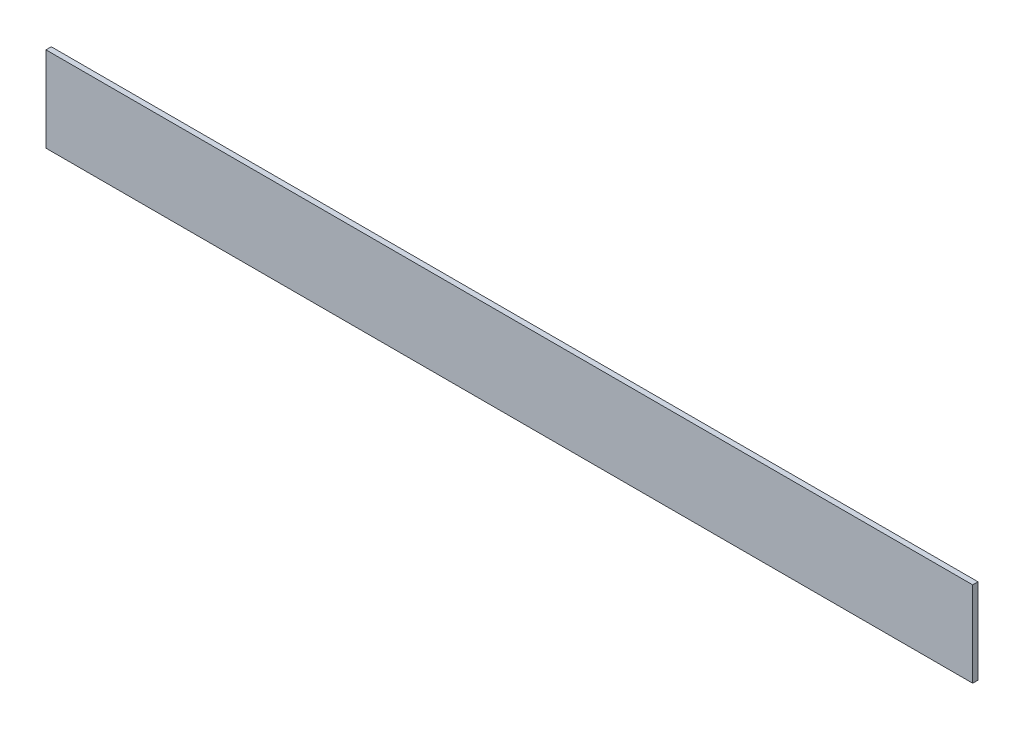
ISO-10303-21;
HEADER;
FILE_DESCRIPTION(('STEP AP214'),'2;1');
FILE_NAME('part.step','',(''),(''),'','','');
FILE_SCHEMA(('AUTOMOTIVE_DESIGN { 1 0 10303 214 1 1 1 1 }'));
ENDSEC;
DATA;
#1=APPLICATION_CONTEXT('core data for automotive mechanical design processes');
#2=APPLICATION_PROTOCOL_DEFINITION('international standard','automotive_design',2000,#1);
#3=PRODUCT_CONTEXT('',#1,'mechanical');
#4=PRODUCT('Part','Part','',(#3));
#5=PRODUCT_RELATED_PRODUCT_CATEGORY('part','',(#4));
#6=PRODUCT_DEFINITION_FORMATION('','',#4);
#7=PRODUCT_DEFINITION_CONTEXT('part definition',#1,'design');
#8=PRODUCT_DEFINITION('design','',#6,#7);
#9=PRODUCT_DEFINITION_SHAPE('','',#8);
#10=(LENGTH_UNIT() NAMED_UNIT(*) SI_UNIT(.MILLI.,.METRE.));
#11=(NAMED_UNIT(*) PLANE_ANGLE_UNIT() SI_UNIT($,.RADIAN.));
#12=(NAMED_UNIT(*) SI_UNIT($,.STERADIAN.) SOLID_ANGLE_UNIT());
#13=UNCERTAINTY_MEASURE_WITH_UNIT(LENGTH_MEASURE(1.E-05),#10,'distance_accuracy_value','');
#14=(GEOMETRIC_REPRESENTATION_CONTEXT(3) GLOBAL_UNCERTAINTY_ASSIGNED_CONTEXT((#13)) GLOBAL_UNIT_ASSIGNED_CONTEXT((#10,
#11,#12)) REPRESENTATION_CONTEXT('',''));
#15=CARTESIAN_POINT('',(0.,0.,0.));
#16=DIRECTION('',(0.,0.,1.));
#17=DIRECTION('',(1.,0.,0.));
#18=AXIS2_PLACEMENT_3D('',#15,#16,#17);
#19=CARTESIAN_POINT('',(0.,0.,3.175));
#20=DIRECTION('',(1.,0.,0.));
#21=DIRECTION('',(0.,0.,-1.));
#22=AXIS2_PLACEMENT_3D('',#19,#20,#21);
#23=PLANE('',#22);
#24=DIRECTION('',(0.,-1.,0.));
#25=VECTOR('',#24,1.);
#26=CARTESIAN_POINT('',(0.,0.,0.));
#27=LINE('',#26,#25);
#28=CARTESIAN_POINT('',(0.,50.8,0.));
#29=VERTEX_POINT('',#28);
#30=CARTESIAN_POINT('',(0.,0.,0.));
#31=VERTEX_POINT('',#30);
#32=EDGE_CURVE('E96',#29,#31,#27,.T.);
#33=ORIENTED_EDGE('',*,*,#32,.T.);
#34=DIRECTION('',(0.,0.,-1.));
#35=VECTOR('',#34,1.);
#36=CARTESIAN_POINT('',(0.,0.,3.175));
#37=LINE('',#36,#35);
#38=CARTESIAN_POINT('',(0.,0.,3.175));
#39=VERTEX_POINT('',#38);
#40=EDGE_CURVE('E11',#39,#31,#37,.T.);
#41=ORIENTED_EDGE('',*,*,#40,.F.);
#42=DIRECTION('',(0.,-1.,0.));
#43=VECTOR('',#42,1.);
#44=CARTESIAN_POINT('',(0.,0.,3.175));
#45=LINE('',#44,#43);
#46=CARTESIAN_POINT('',(0.,50.8,3.175));
#47=VERTEX_POINT('',#46);
#48=EDGE_CURVE('E84',#47,#39,#45,.T.);
#49=ORIENTED_EDGE('',*,*,#48,.F.);
#50=DIRECTION('',(0.,0.,-1.));
#51=VECTOR('',#50,1.);
#52=CARTESIAN_POINT('',(0.,50.8,3.175));
#53=LINE('',#52,#51);
#54=EDGE_CURVE('E92',#47,#29,#53,.T.);
#55=ORIENTED_EDGE('',*,*,#54,.T.);
#56=EDGE_LOOP('',(#33,#41,#49,#55));
#57=FACE_BOUND('',#56,.T.);
#58=ADVANCED_FACE('F33',(#57),#23,.F.);
#59=CARTESIAN_POINT('',(0.,0.,3.175));
#60=DIRECTION('',(0.,1.,0.));
#61=DIRECTION('',(0.,0.,1.));
#62=AXIS2_PLACEMENT_3D('',#59,#60,#61);
#63=PLANE('',#62);
#64=DIRECTION('',(1.,0.,0.));
#65=VECTOR('',#64,1.);
#66=CARTESIAN_POINT('',(0.,0.,0.));
#67=LINE('',#66,#65);
#68=CARTESIAN_POINT('',(552.45,0.,0.));
#69=VERTEX_POINT('',#68);
#70=EDGE_CURVE('E88',#31,#69,#67,.T.);
#71=ORIENTED_EDGE('',*,*,#70,.T.);
#72=DIRECTION('',(0.,0.,-1.));
#73=VECTOR('',#72,1.);
#74=CARTESIAN_POINT('',(552.45,0.,3.175));
#75=LINE('',#74,#73);
#76=CARTESIAN_POINT('',(552.45,0.,3.175));
#77=VERTEX_POINT('',#76);
#78=EDGE_CURVE('E41',#77,#69,#75,.T.);
#79=ORIENTED_EDGE('',*,*,#78,.F.);
#80=DIRECTION('',(1.,0.,0.));
#81=VECTOR('',#80,1.);
#82=CARTESIAN_POINT('',(0.,0.,3.175));
#83=LINE('',#82,#81);
#84=EDGE_CURVE('E79',#39,#77,#83,.T.);
#85=ORIENTED_EDGE('',*,*,#84,.F.);
#86=ORIENTED_EDGE('',*,*,#40,.T.);
#87=EDGE_LOOP('',(#71,#79,#85,#86));
#88=FACE_BOUND('',#87,.T.);
#89=ADVANCED_FACE('F87',(#88),#63,.F.);
#90=CARTESIAN_POINT('',(552.45,0.,3.175));
#91=DIRECTION('',(-1.,0.,0.));
#92=DIRECTION('',(0.,0.,1.));
#93=AXIS2_PLACEMENT_3D('',#90,#91,#92);
#94=PLANE('',#93);
#95=DIRECTION('',(0.,1.,0.));
#96=VECTOR('',#95,1.);
#97=CARTESIAN_POINT('',(552.45,0.,0.));
#98=LINE('',#97,#96);
#99=CARTESIAN_POINT('',(552.45,50.8,0.));
#100=VERTEX_POINT('',#99);
#101=EDGE_CURVE('E66',#69,#100,#98,.T.);
#102=ORIENTED_EDGE('',*,*,#101,.T.);
#103=DIRECTION('',(0.,0.,-1.));
#104=VECTOR('',#103,1.);
#105=CARTESIAN_POINT('',(552.45,50.8,3.175));
#106=LINE('',#105,#104);
#107=CARTESIAN_POINT('',(552.45,50.8,3.175));
#108=VERTEX_POINT('',#107);
#109=EDGE_CURVE('E89',#108,#100,#106,.T.);
#110=ORIENTED_EDGE('',*,*,#109,.F.);
#111=DIRECTION('',(0.,1.,0.));
#112=VECTOR('',#111,1.);
#113=CARTESIAN_POINT('',(552.45,0.,3.175));
#114=LINE('',#113,#112);
#115=EDGE_CURVE('E82',#77,#108,#114,.T.);
#116=ORIENTED_EDGE('',*,*,#115,.F.);
#117=ORIENTED_EDGE('',*,*,#78,.T.);
#118=EDGE_LOOP('',(#102,#110,#116,#117));
#119=FACE_BOUND('',#118,.T.);
#120=ADVANCED_FACE('F90',(#119),#94,.F.);
#121=CARTESIAN_POINT('',(0.,50.8,3.175));
#122=DIRECTION('',(0.,-1.,0.));
#123=DIRECTION('',(0.,0.,-1.));
#124=AXIS2_PLACEMENT_3D('',#121,#122,#123);
#125=PLANE('',#124);
#126=DIRECTION('',(-1.,0.,0.));
#127=VECTOR('',#126,1.);
#128=CARTESIAN_POINT('',(0.,50.8,0.));
#129=LINE('',#128,#127);
#130=EDGE_CURVE('E72',#100,#29,#129,.T.);
#131=ORIENTED_EDGE('',*,*,#130,.T.);
#132=ORIENTED_EDGE('',*,*,#54,.F.);
#133=DIRECTION('',(-1.,0.,0.));
#134=VECTOR('',#133,1.);
#135=CARTESIAN_POINT('',(0.,50.8,3.175));
#136=LINE('',#135,#134);
#137=EDGE_CURVE('E49',#108,#47,#136,.T.);
#138=ORIENTED_EDGE('',*,*,#137,.F.);
#139=ORIENTED_EDGE('',*,*,#109,.T.);
#140=EDGE_LOOP('',(#131,#132,#138,#139));
#141=FACE_BOUND('',#140,.T.);
#142=ADVANCED_FACE('F103',(#141),#125,.F.);
#143=CARTESIAN_POINT('',(0.,0.,3.175));
#144=DIRECTION('',(0.,0.,-1.));
#145=DIRECTION('',(-1.,0.,0.));
#146=AXIS2_PLACEMENT_3D('',#143,#144,#145);
#147=PLANE('',#146);
#148=ORIENTED_EDGE('',*,*,#48,.T.);
#149=ORIENTED_EDGE('',*,*,#84,.T.);
#150=ORIENTED_EDGE('',*,*,#115,.T.);
#151=ORIENTED_EDGE('',*,*,#137,.T.);
#152=EDGE_LOOP('',(#148,#149,#150,#151));
#153=FACE_BOUND('',#152,.T.);
#154=ADVANCED_FACE('F80',(#153),#147,.F.);
#155=CARTESIAN_POINT('',(0.,0.,0.));
#156=DIRECTION('',(0.,0.,-1.));
#157=DIRECTION('',(-1.,0.,0.));
#158=AXIS2_PLACEMENT_3D('',#155,#156,#157);
#159=PLANE('',#158);
#160=ORIENTED_EDGE('',*,*,#32,.F.);
#161=ORIENTED_EDGE('',*,*,#130,.F.);
#162=ORIENTED_EDGE('',*,*,#101,.F.);
#163=ORIENTED_EDGE('',*,*,#70,.F.);
#164=EDGE_LOOP('',(#160,#161,#162,#163));
#165=FACE_BOUND('',#164,.T.);
#166=ADVANCED_FACE('F106',(#165),#159,.T.);
#167=CLOSED_SHELL('',(#58,#89,#120,#142,#154,#166));
#168=MANIFOLD_SOLID_BREP('B2',#167);
#169=ADVANCED_BREP_SHAPE_REPRESENTATION('',(#18,#168),#14);
#170=SHAPE_DEFINITION_REPRESENTATION(#9,#169);
ENDSEC;
END-ISO-10303-21;
